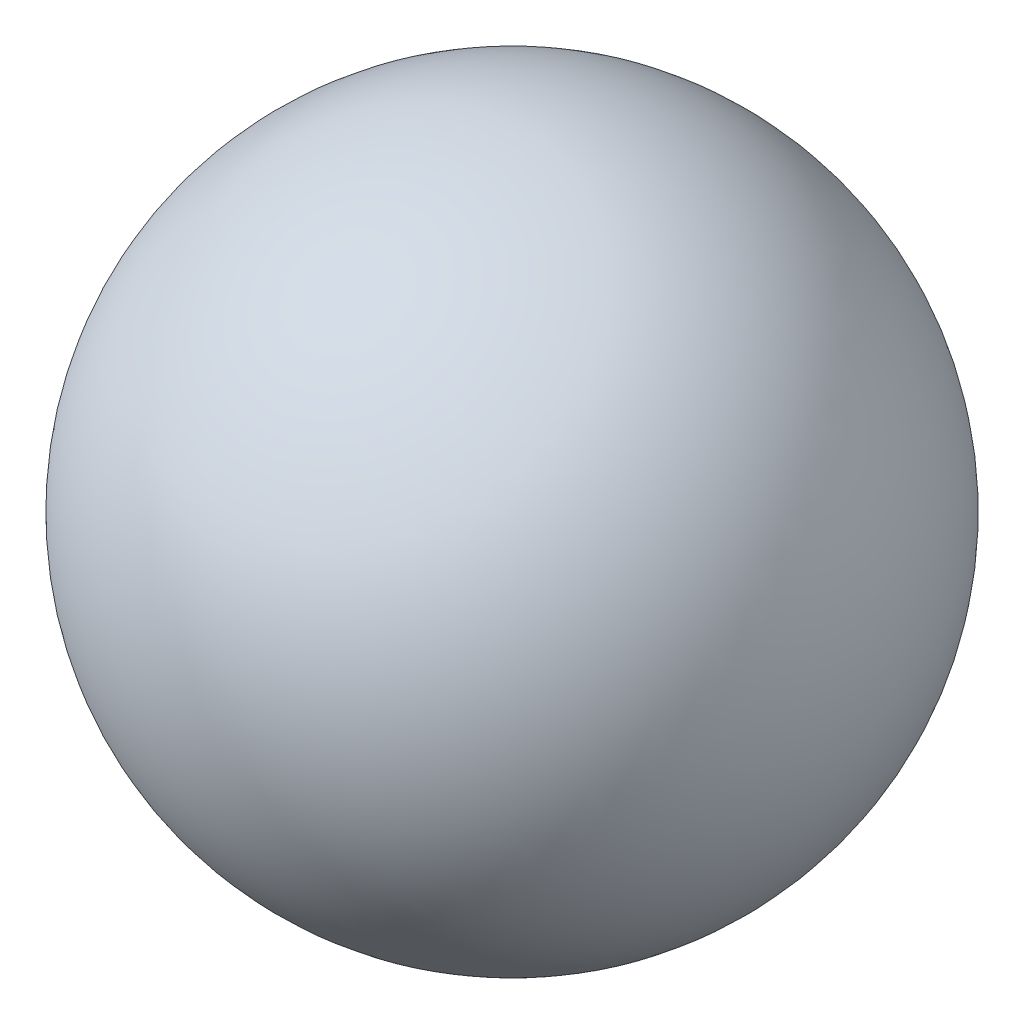
ISO-10303-21;
HEADER;
FILE_DESCRIPTION(('STEP AP214'),'2;1');
FILE_NAME('part.step','',(''),(''),'','','');
FILE_SCHEMA(('AUTOMOTIVE_DESIGN { 1 0 10303 214 1 1 1 1 }'));
ENDSEC;
DATA;
#1=APPLICATION_CONTEXT('core data for automotive mechanical design processes');
#2=APPLICATION_PROTOCOL_DEFINITION('international standard','automotive_design',2000,#1);
#3=PRODUCT_CONTEXT('',#1,'mechanical');
#4=PRODUCT('Part','Part','',(#3));
#5=PRODUCT_RELATED_PRODUCT_CATEGORY('part','',(#4));
#6=PRODUCT_DEFINITION_FORMATION('','',#4);
#7=PRODUCT_DEFINITION_CONTEXT('part definition',#1,'design');
#8=PRODUCT_DEFINITION('design','',#6,#7);
#9=PRODUCT_DEFINITION_SHAPE('','',#8);
#10=(LENGTH_UNIT() NAMED_UNIT(*) SI_UNIT(.MILLI.,.METRE.));
#11=(NAMED_UNIT(*) PLANE_ANGLE_UNIT() SI_UNIT($,.RADIAN.));
#12=(NAMED_UNIT(*) SI_UNIT($,.STERADIAN.) SOLID_ANGLE_UNIT());
#13=UNCERTAINTY_MEASURE_WITH_UNIT(LENGTH_MEASURE(1.E-05),#10,'distance_accuracy_value','');
#14=(GEOMETRIC_REPRESENTATION_CONTEXT(3) GLOBAL_UNCERTAINTY_ASSIGNED_CONTEXT((#13)) GLOBAL_UNIT_ASSIGNED_CONTEXT((#10,
#11,#12)) REPRESENTATION_CONTEXT('',''));
#15=CARTESIAN_POINT('',(0.,0.,0.));
#16=DIRECTION('',(0.,0.,1.));
#17=DIRECTION('',(1.,0.,0.));
#18=AXIS2_PLACEMENT_3D('',#15,#16,#17);
#19=CARTESIAN_POINT('',(0.,0.,0.));
#20=DIRECTION('',(0.,1.,0.));
#21=DIRECTION('',(1.,0.,0.));
#22=AXIS2_PLACEMENT_3D('',#19,#20,#21);
#23=SPHERICAL_SURFACE('',#22,1620.000000024);
#24=CARTESIAN_POINT('',(0.,1620.000000024,0.));
#25=VERTEX_POINT('',#24);
#26=VERTEX_LOOP('',#25);
#27=FACE_BOUND('',#26,.T.);
#28=ADVANCED_FACE('F33',(#27),#23,.T.);
#29=CLOSED_SHELL('',(#28));
#30=MANIFOLD_SOLID_BREP('B2',#29);
#31=ADVANCED_BREP_SHAPE_REPRESENTATION('',(#18,#30),#14);
#32=SHAPE_DEFINITION_REPRESENTATION(#9,#31);
ENDSEC;
END-ISO-10303-21;
